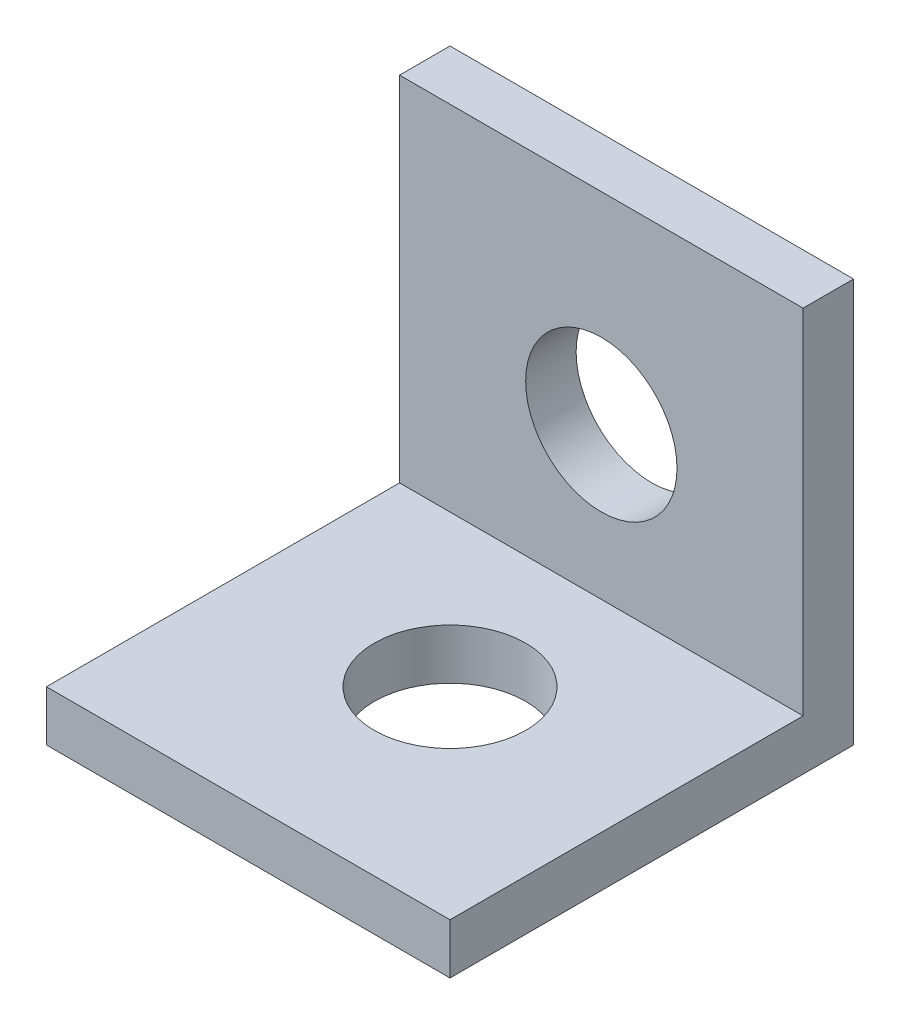
ISO-10303-21;
HEADER;
FILE_DESCRIPTION(('STEP AP214'),'2;1');
FILE_NAME('part.step','',(''),(''),'','','');
FILE_SCHEMA(('AUTOMOTIVE_DESIGN { 1 0 10303 214 1 1 1 1 }'));
ENDSEC;
DATA;
#1=APPLICATION_CONTEXT('core data for automotive mechanical design processes');
#2=APPLICATION_PROTOCOL_DEFINITION('international standard','automotive_design',2000,#1);
#3=PRODUCT_CONTEXT('',#1,'mechanical');
#4=PRODUCT('Part','Part','',(#3));
#5=PRODUCT_RELATED_PRODUCT_CATEGORY('part','',(#4));
#6=PRODUCT_DEFINITION_FORMATION('','',#4);
#7=PRODUCT_DEFINITION_CONTEXT('part definition',#1,'design');
#8=PRODUCT_DEFINITION('design','',#6,#7);
#9=PRODUCT_DEFINITION_SHAPE('','',#8);
#10=(LENGTH_UNIT() NAMED_UNIT(*) SI_UNIT(.MILLI.,.METRE.));
#11=(NAMED_UNIT(*) PLANE_ANGLE_UNIT() SI_UNIT($,.RADIAN.));
#12=(NAMED_UNIT(*) SI_UNIT($,.STERADIAN.) SOLID_ANGLE_UNIT());
#13=UNCERTAINTY_MEASURE_WITH_UNIT(LENGTH_MEASURE(1.E-05),#10,'distance_accuracy_value','');
#14=(GEOMETRIC_REPRESENTATION_CONTEXT(3) GLOBAL_UNCERTAINTY_ASSIGNED_CONTEXT((#13)) GLOBAL_UNIT_ASSIGNED_CONTEXT((#10,
#11,#12)) REPRESENTATION_CONTEXT('',''));
#15=CARTESIAN_POINT('',(0.,0.,0.));
#16=DIRECTION('',(0.,0.,1.));
#17=DIRECTION('',(1.,0.,0.));
#18=AXIS2_PLACEMENT_3D('',#15,#16,#17);
#19=CARTESIAN_POINT('',(25.4,25.4,0.));
#20=DIRECTION('',(0.,0.,1.));
#21=DIRECTION('',(0.,-1.,0.));
#22=AXIS2_PLACEMENT_3D('',#19,#20,#21);
#23=PLANE('',#22);
#24=CARTESIAN_POINT('',(12.7,12.7,0.));
#25=DIRECTION('',(0.,0.,1.));
#26=DIRECTION('',(1.,0.,0.));
#27=AXIS2_PLACEMENT_3D('',#24,#25,#26);
#28=CIRCLE('',#27,4.7625);
#29=CARTESIAN_POINT('',(17.4625,12.7,0.));
#30=VERTEX_POINT('',#29);
#31=EDGE_CURVE('E162',#30,#30,#28,.T.);
#32=ORIENTED_EDGE('',*,*,#31,.T.);
#33=EDGE_LOOP('',(#32));
#34=FACE_BOUND('',#33,.T.);
#35=DIRECTION('',(0.,1.,0.));
#36=VECTOR('',#35,1.);
#37=CARTESIAN_POINT('',(0.,25.4,0.));
#38=LINE('',#37,#36);
#39=CARTESIAN_POINT('',(0.,0.,0.));
#40=VERTEX_POINT('',#39);
#41=CARTESIAN_POINT('',(0.,25.4,0.));
#42=VERTEX_POINT('',#41);
#43=EDGE_CURVE('E118',#40,#42,#38,.T.);
#44=ORIENTED_EDGE('',*,*,#43,.T.);
#45=DIRECTION('',(-1.,0.,0.));
#46=VECTOR('',#45,1.);
#47=CARTESIAN_POINT('',(25.4,25.4,0.));
#48=LINE('',#47,#46);
#49=CARTESIAN_POINT('',(25.4,25.4,0.));
#50=VERTEX_POINT('',#49);
#51=EDGE_CURVE('E11',#50,#42,#48,.T.);
#52=ORIENTED_EDGE('',*,*,#51,.F.);
#53=DIRECTION('',(0.,1.,0.));
#54=VECTOR('',#53,1.);
#55=CARTESIAN_POINT('',(25.4,25.4,0.));
#56=LINE('',#55,#54);
#57=CARTESIAN_POINT('',(25.4,0.,0.));
#58=VERTEX_POINT('',#57);
#59=EDGE_CURVE('E128',#58,#50,#56,.T.);
#60=ORIENTED_EDGE('',*,*,#59,.F.);
#61=DIRECTION('',(-1.,0.,0.));
#62=VECTOR('',#61,1.);
#63=CARTESIAN_POINT('',(25.4,0.,0.));
#64=LINE('',#63,#62);
#65=EDGE_CURVE('E114',#58,#40,#64,.T.);
#66=ORIENTED_EDGE('',*,*,#65,.T.);
#67=EDGE_LOOP('',(#44,#52,#60,#66));
#68=FACE_BOUND('',#67,.T.);
#69=ADVANCED_FACE('F33',(#34,#68),#23,.F.);
#70=CARTESIAN_POINT('',(25.4,25.4,3.1750000000001));
#71=DIRECTION('',(0.,-1.,0.));
#72=DIRECTION('',(0.,0.,-1.));
#73=AXIS2_PLACEMENT_3D('',#70,#71,#72);
#74=PLANE('',#73);
#75=DIRECTION('',(0.,0.,1.));
#76=VECTOR('',#75,1.);
#77=CARTESIAN_POINT('',(0.,25.4,3.1750000000001));
#78=LINE('',#77,#76);
#79=CARTESIAN_POINT('',(0.,25.4,3.1750000000001));
#80=VERTEX_POINT('',#79);
#81=EDGE_CURVE('E121',#42,#80,#78,.T.);
#82=ORIENTED_EDGE('',*,*,#81,.T.);
#83=DIRECTION('',(-1.,0.,0.));
#84=VECTOR('',#83,1.);
#85=CARTESIAN_POINT('',(25.4,25.4,3.1750000000001));
#86=LINE('',#85,#84);
#87=CARTESIAN_POINT('',(25.4,25.4,3.1750000000001));
#88=VERTEX_POINT('',#87);
#89=EDGE_CURVE('E42',#88,#80,#86,.T.);
#90=ORIENTED_EDGE('',*,*,#89,.F.);
#91=DIRECTION('',(0.,0.,1.));
#92=VECTOR('',#91,1.);
#93=CARTESIAN_POINT('',(25.4,25.4,3.1750000000001));
#94=LINE('',#93,#92);
#95=EDGE_CURVE('E87',#50,#88,#94,.T.);
#96=ORIENTED_EDGE('',*,*,#95,.F.);
#97=ORIENTED_EDGE('',*,*,#51,.T.);
#98=EDGE_LOOP('',(#82,#90,#96,#97));
#99=FACE_BOUND('',#98,.T.);
#100=ADVANCED_FACE('F155',(#99),#74,.F.);
#101=CARTESIAN_POINT('',(25.4,3.175,3.17500000000001));
#102=DIRECTION('',(0.,0.,-1.));
#103=DIRECTION('',(0.,1.,0.));
#104=AXIS2_PLACEMENT_3D('',#101,#102,#103);
#105=PLANE('',#104);
#106=CARTESIAN_POINT('',(12.7,12.7,3.175));
#107=DIRECTION('',(0.,0.,1.));
#108=DIRECTION('',(1.,0.,0.));
#109=AXIS2_PLACEMENT_3D('',#106,#107,#108);
#110=CIRCLE('',#109,4.7625);
#111=CARTESIAN_POINT('',(17.4625,12.7,3.175));
#112=VERTEX_POINT('',#111);
#113=EDGE_CURVE('E165',#112,#112,#110,.T.);
#114=ORIENTED_EDGE('',*,*,#113,.F.);
#115=EDGE_LOOP('',(#114));
#116=FACE_BOUND('',#115,.T.);
#117=DIRECTION('',(0.,-1.,0.));
#118=VECTOR('',#117,1.);
#119=CARTESIAN_POINT('',(0.,3.175,3.17500000000001));
#120=LINE('',#119,#118);
#121=CARTESIAN_POINT('',(0.,3.175,3.17500000000001));
#122=VERTEX_POINT('',#121);
#123=EDGE_CURVE('E123',#80,#122,#120,.T.);
#124=ORIENTED_EDGE('',*,*,#123,.T.);
#125=DIRECTION('',(-1.,0.,0.));
#126=VECTOR('',#125,1.);
#127=CARTESIAN_POINT('',(25.4,3.175,3.17500000000001));
#128=LINE('',#127,#126);
#129=CARTESIAN_POINT('',(25.4,3.175,3.17500000000001));
#130=VERTEX_POINT('',#129);
#131=EDGE_CURVE('E109',#130,#122,#128,.T.);
#132=ORIENTED_EDGE('',*,*,#131,.F.);
#133=DIRECTION('',(0.,-1.,0.));
#134=VECTOR('',#133,1.);
#135=CARTESIAN_POINT('',(25.4,3.175,3.17500000000001));
#136=LINE('',#135,#134);
#137=EDGE_CURVE('E100',#88,#130,#136,.T.);
#138=ORIENTED_EDGE('',*,*,#137,.F.);
#139=ORIENTED_EDGE('',*,*,#89,.T.);
#140=EDGE_LOOP('',(#124,#132,#138,#139));
#141=FACE_BOUND('',#140,.T.);
#142=ADVANCED_FACE('F135',(#116,#141),#105,.F.);
#143=CARTESIAN_POINT('',(25.4,3.175,25.4));
#144=DIRECTION('',(0.,-1.,0.));
#145=DIRECTION('',(0.,0.,-1.));
#146=AXIS2_PLACEMENT_3D('',#143,#144,#145);
#147=PLANE('',#146);
#148=CARTESIAN_POINT('',(12.7,3.175,12.7));
#149=DIRECTION('',(0.,1.,0.));
#150=DIRECTION('',(0.,0.,1.));
#151=AXIS2_PLACEMENT_3D('',#148,#149,#150);
#152=CIRCLE('',#151,4.7625);
#153=CARTESIAN_POINT('',(12.7,3.175,17.4625));
#154=VERTEX_POINT('',#153);
#155=EDGE_CURVE('E164',#154,#154,#152,.T.);
#156=ORIENTED_EDGE('',*,*,#155,.F.);
#157=EDGE_LOOP('',(#156));
#158=FACE_BOUND('',#157,.T.);
#159=DIRECTION('',(0.,0.,1.));
#160=VECTOR('',#159,1.);
#161=CARTESIAN_POINT('',(0.,3.175,25.4));
#162=LINE('',#161,#160);
#163=CARTESIAN_POINT('',(0.,3.175,25.4));
#164=VERTEX_POINT('',#163);
#165=EDGE_CURVE('E108',#122,#164,#162,.T.);
#166=ORIENTED_EDGE('',*,*,#165,.T.);
#167=DIRECTION('',(-1.,0.,0.));
#168=VECTOR('',#167,1.);
#169=CARTESIAN_POINT('',(25.4,3.175,25.4));
#170=LINE('',#169,#168);
#171=CARTESIAN_POINT('',(25.4,3.175,25.4));
#172=VERTEX_POINT('',#171);
#173=EDGE_CURVE('E105',#172,#164,#170,.T.);
#174=ORIENTED_EDGE('',*,*,#173,.F.);
#175=DIRECTION('',(0.,0.,1.));
#176=VECTOR('',#175,1.);
#177=CARTESIAN_POINT('',(25.4,3.175,25.4));
#178=LINE('',#177,#176);
#179=EDGE_CURVE('E94',#130,#172,#178,.T.);
#180=ORIENTED_EDGE('',*,*,#179,.F.);
#181=ORIENTED_EDGE('',*,*,#131,.T.);
#182=EDGE_LOOP('',(#166,#174,#180,#181));
#183=FACE_BOUND('',#182,.T.);
#184=ADVANCED_FACE('F106',(#158,#183),#147,.F.);
#185=CARTESIAN_POINT('',(25.4,0.,25.4));
#186=DIRECTION('',(0.,0.,-1.));
#187=DIRECTION('',(-1.,0.,0.));
#188=AXIS2_PLACEMENT_3D('',#185,#186,#187);
#189=PLANE('',#188);
#190=DIRECTION('',(0.,-1.,0.));
#191=VECTOR('',#190,1.);
#192=CARTESIAN_POINT('',(0.,0.,25.4));
#193=LINE('',#192,#191);
#194=CARTESIAN_POINT('',(0.,0.,25.4));
#195=VERTEX_POINT('',#194);
#196=EDGE_CURVE('E73',#164,#195,#193,.T.);
#197=ORIENTED_EDGE('',*,*,#196,.T.);
#198=DIRECTION('',(-1.,0.,0.));
#199=VECTOR('',#198,1.);
#200=CARTESIAN_POINT('',(25.4,0.,25.4));
#201=LINE('',#200,#199);
#202=CARTESIAN_POINT('',(25.4,0.,25.4));
#203=VERTEX_POINT('',#202);
#204=EDGE_CURVE('E110',#203,#195,#201,.T.);
#205=ORIENTED_EDGE('',*,*,#204,.F.);
#206=DIRECTION('',(0.,-1.,0.));
#207=VECTOR('',#206,1.);
#208=CARTESIAN_POINT('',(25.4,0.,25.4));
#209=LINE('',#208,#207);
#210=EDGE_CURVE('E98',#172,#203,#209,.T.);
#211=ORIENTED_EDGE('',*,*,#210,.F.);
#212=ORIENTED_EDGE('',*,*,#173,.T.);
#213=EDGE_LOOP('',(#197,#205,#211,#212));
#214=FACE_BOUND('',#213,.T.);
#215=ADVANCED_FACE('F112',(#214),#189,.F.);
#216=CARTESIAN_POINT('',(25.4,0.,0.));
#217=DIRECTION('',(0.,1.,0.));
#218=DIRECTION('',(0.,0.,1.));
#219=AXIS2_PLACEMENT_3D('',#216,#217,#218);
#220=PLANE('',#219);
#221=CARTESIAN_POINT('',(12.7,0.,12.7));
#222=DIRECTION('',(0.,1.,0.));
#223=DIRECTION('',(0.,0.,1.));
#224=AXIS2_PLACEMENT_3D('',#221,#222,#223);
#225=CIRCLE('',#224,4.7625);
#226=CARTESIAN_POINT('',(12.7,0.,17.4625));
#227=VERTEX_POINT('',#226);
#228=EDGE_CURVE('E36',#227,#227,#225,.T.);
#229=ORIENTED_EDGE('',*,*,#228,.T.);
#230=EDGE_LOOP('',(#229));
#231=FACE_BOUND('',#230,.T.);
#232=DIRECTION('',(0.,0.,-1.));
#233=VECTOR('',#232,1.);
#234=CARTESIAN_POINT('',(0.,0.,0.));
#235=LINE('',#234,#233);
#236=EDGE_CURVE('E79',#195,#40,#235,.T.);
#237=ORIENTED_EDGE('',*,*,#236,.T.);
#238=ORIENTED_EDGE('',*,*,#65,.F.);
#239=DIRECTION('',(0.,0.,-1.));
#240=VECTOR('',#239,1.);
#241=CARTESIAN_POINT('',(25.4,0.,0.));
#242=LINE('',#241,#240);
#243=EDGE_CURVE('E50',#203,#58,#242,.T.);
#244=ORIENTED_EDGE('',*,*,#243,.F.);
#245=ORIENTED_EDGE('',*,*,#204,.T.);
#246=EDGE_LOOP('',(#237,#238,#244,#245));
#247=FACE_BOUND('',#246,.T.);
#248=ADVANCED_FACE('F142',(#231,#247),#220,.F.);
#249=CARTESIAN_POINT('',(25.4,0.,0.));
#250=DIRECTION('',(-1.,0.,0.));
#251=DIRECTION('',(0.,0.,1.));
#252=AXIS2_PLACEMENT_3D('',#249,#250,#251);
#253=PLANE('',#252);
#254=ORIENTED_EDGE('',*,*,#59,.T.);
#255=ORIENTED_EDGE('',*,*,#95,.T.);
#256=ORIENTED_EDGE('',*,*,#137,.T.);
#257=ORIENTED_EDGE('',*,*,#179,.T.);
#258=ORIENTED_EDGE('',*,*,#210,.T.);
#259=ORIENTED_EDGE('',*,*,#243,.T.);
#260=EDGE_LOOP('',(#254,#255,#256,#257,#258,#259));
#261=FACE_BOUND('',#260,.T.);
#262=ADVANCED_FACE('F96',(#261),#253,.F.);
#263=CARTESIAN_POINT('',(0.,0.,0.));
#264=DIRECTION('',(-1.,0.,0.));
#265=DIRECTION('',(0.,0.,1.));
#266=AXIS2_PLACEMENT_3D('',#263,#264,#265);
#267=PLANE('',#266);
#268=ORIENTED_EDGE('',*,*,#43,.F.);
#269=ORIENTED_EDGE('',*,*,#236,.F.);
#270=ORIENTED_EDGE('',*,*,#196,.F.);
#271=ORIENTED_EDGE('',*,*,#165,.F.);
#272=ORIENTED_EDGE('',*,*,#123,.F.);
#273=ORIENTED_EDGE('',*,*,#81,.F.);
#274=EDGE_LOOP('',(#268,#269,#270,#271,#272,#273));
#275=FACE_BOUND('',#274,.T.);
#276=ADVANCED_FACE('F138',(#275),#267,.T.);
#277=CARTESIAN_POINT('',(12.7,-22.225,12.7));
#278=DIRECTION('',(0.,1.,0.));
#279=DIRECTION('',(0.,0.,1.));
#280=AXIS2_PLACEMENT_3D('',#277,#278,#279);
#281=CYLINDRICAL_SURFACE('',#280,4.7625);
#282=ORIENTED_EDGE('',*,*,#155,.T.);
#283=EDGE_LOOP('',(#282));
#284=FACE_BOUND('',#283,.T.);
#285=ORIENTED_EDGE('',*,*,#228,.F.);
#286=EDGE_LOOP('',(#285));
#287=FACE_BOUND('',#286,.T.);
#288=ADVANCED_FACE('F188',(#284,#287),#281,.F.);
#289=CARTESIAN_POINT('',(12.7,12.7,0.));
#290=DIRECTION('',(0.,0.,1.));
#291=DIRECTION('',(1.,0.,0.));
#292=AXIS2_PLACEMENT_3D('',#289,#290,#291);
#293=CYLINDRICAL_SURFACE('',#292,4.7625);
#294=ORIENTED_EDGE('',*,*,#31,.F.);
#295=EDGE_LOOP('',(#294));
#296=FACE_BOUND('',#295,.T.);
#297=ORIENTED_EDGE('',*,*,#113,.T.);
#298=EDGE_LOOP('',(#297));
#299=FACE_BOUND('',#298,.T.);
#300=ADVANCED_FACE('F175',(#296,#299),#293,.F.);
#301=CLOSED_SHELL('',(#69,#100,#142,#184,#215,#248,#262,#276,#288,#300));
#302=MANIFOLD_SOLID_BREP('B2',#301);
#303=ADVANCED_BREP_SHAPE_REPRESENTATION('',(#18,#302),#14);
#304=SHAPE_DEFINITION_REPRESENTATION(#9,#303);
ENDSEC;
END-ISO-10303-21;
